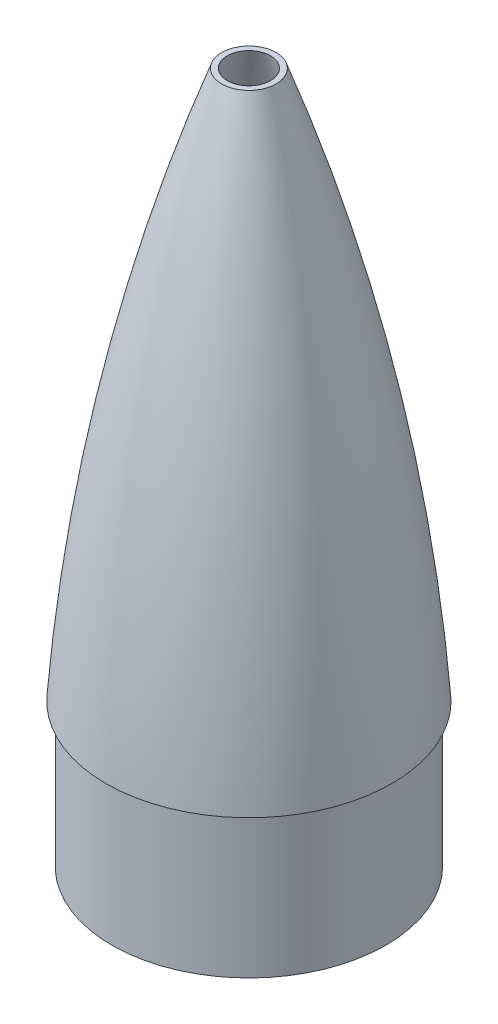
ISO-10303-21;
HEADER;
FILE_DESCRIPTION(('STEP AP214'),'2;1');
FILE_NAME('part.step','',(''),(''),'','','');
FILE_SCHEMA(('AUTOMOTIVE_DESIGN { 1 0 10303 214 1 1 1 1 }'));
ENDSEC;
DATA;
#1=APPLICATION_CONTEXT('core data for automotive mechanical design processes');
#2=APPLICATION_PROTOCOL_DEFINITION('international standard','automotive_design',2000,#1);
#3=PRODUCT_CONTEXT('',#1,'mechanical');
#4=PRODUCT('Part','Part','',(#3));
#5=PRODUCT_RELATED_PRODUCT_CATEGORY('part','',(#4));
#6=PRODUCT_DEFINITION_FORMATION('','',#4);
#7=PRODUCT_DEFINITION_CONTEXT('part definition',#1,'design');
#8=PRODUCT_DEFINITION('design','',#6,#7);
#9=PRODUCT_DEFINITION_SHAPE('','',#8);
#10=(LENGTH_UNIT() NAMED_UNIT(*) SI_UNIT(.MILLI.,.METRE.));
#11=(NAMED_UNIT(*) PLANE_ANGLE_UNIT() SI_UNIT($,.RADIAN.));
#12=(NAMED_UNIT(*) SI_UNIT($,.STERADIAN.) SOLID_ANGLE_UNIT());
#13=UNCERTAINTY_MEASURE_WITH_UNIT(LENGTH_MEASURE(1.E-05),#10,'distance_accuracy_value','');
#14=(GEOMETRIC_REPRESENTATION_CONTEXT(3) GLOBAL_UNCERTAINTY_ASSIGNED_CONTEXT((#13)) GLOBAL_UNIT_ASSIGNED_CONTEXT((#10,
#11,#12)) REPRESENTATION_CONTEXT('',''));
#15=CARTESIAN_POINT('',(0.,0.,0.));
#16=DIRECTION('',(0.,0.,1.));
#17=DIRECTION('',(1.,0.,0.));
#18=AXIS2_PLACEMENT_3D('',#15,#16,#17);
#19=CARTESIAN_POINT('',(2.22044604925031E-13,-77.7824394206784,0.));
#20=DIRECTION('',(0.,1.,0.));
#21=DIRECTION('',(-1.,0.,0.));
#22=AXIS2_PLACEMENT_3D('',#19,#20,#21);
#23=DEGENERATE_TOROIDAL_SURFACE('',#22,1014.39057082294,1093.36082838655,.F.);
#24=CARTESIAN_POINT('',(2.42627023847075E-13,0.,0.));
#25=DIRECTION('',(0.,1.,0.));
#26=DIRECTION('',(-1.,0.,0.));
#27=AXIS2_PLACEMENT_3D('',#24,#25,#26);
#28=CIRCLE('',#27,76.2000000000002);
#29=CARTESIAN_POINT('',(-76.2,0.,0.));
#30=VERTEX_POINT('',#29);
#31=EDGE_CURVE('E45',#30,#30,#28,.T.);
#32=ORIENTED_EDGE('',*,*,#31,.T.);
#33=EDGE_LOOP('',(#32));
#34=FACE_BOUND('',#33,.T.);
#35=CARTESIAN_POINT('',(2.22044604925031E-13,292.1,0.));
#36=DIRECTION('',(0.,1.,0.));
#37=DIRECTION('',(0.,0.,1.));
#38=AXIS2_PLACEMENT_3D('',#35,#36,#37);
#39=CIRCLE('',#38,14.5044102408933);
#40=CARTESIAN_POINT('',(2.22044604925031E-13,292.1,14.5044102408933));
#41=VERTEX_POINT('',#40);
#42=EDGE_CURVE('E55',#41,#41,#39,.F.);
#43=ORIENTED_EDGE('',*,*,#42,.T.);
#44=EDGE_LOOP('',(#43));
#45=FACE_BOUND('',#44,.T.);
#46=ADVANCED_FACE('F38',(#34,#45),#23,.F.);
#47=CARTESIAN_POINT('',(2.22044604925031E-13,-88.4854003678518,0.));
#48=DIRECTION('',(0.,1.,0.));
#49=DIRECTION('',(-1.,0.,0.));
#50=AXIS2_PLACEMENT_3D('',#47,#48,#49);
#51=DEGENERATE_TOROIDAL_SURFACE('',#50,1133.57722716672,1206.67591223346,.F.);
#52=CARTESIAN_POINT('',(2.42627023847075E-13,-1.11022302462516E-13,0.));
#53=DIRECTION('',(0.,1.,0.));
#54=DIRECTION('',(-1.,0.,0.));
#55=AXIS2_PLACEMENT_3D('',#52,#53,#54);
#56=CIRCLE('',#55,69.8500000000002);
#57=CARTESIAN_POINT('',(-69.85,-1.62347249814782E-13,0.));
#58=VERTEX_POINT('',#57);
#59=EDGE_CURVE('E50',#58,#58,#56,.T.);
#60=ORIENTED_EDGE('',*,*,#59,.F.);
#61=EDGE_LOOP('',(#60));
#62=FACE_BOUND('',#61,.T.);
#63=CARTESIAN_POINT('',(2.22044604925031E-13,292.1,0.));
#64=DIRECTION('',(0.,1.,0.));
#65=DIRECTION('',(0.,0.,1.));
#66=AXIS2_PLACEMENT_3D('',#63,#64,#65);
#67=CIRCLE('',#66,11.5085819285119);
#68=CARTESIAN_POINT('',(2.22044604925031E-13,292.1,11.5085819285119));
#69=VERTEX_POINT('',#68);
#70=EDGE_CURVE('E41',#69,#69,#67,.T.);
#71=ORIENTED_EDGE('',*,*,#70,.T.);
#72=EDGE_LOOP('',(#71));
#73=FACE_BOUND('',#72,.T.);
#74=ADVANCED_FACE('F63',(#62,#73),#51,.T.);
#75=CARTESIAN_POINT('',(-76.2,0.,0.));
#76=DIRECTION('',(0.,-1.,0.));
#77=DIRECTION('',(1.,0.,0.));
#78=AXIS2_PLACEMENT_3D('',#75,#76,#77);
#79=PLANE('',#78);
#80=CARTESIAN_POINT('',(0.,0.,0.));
#81=DIRECTION('',(0.,-1.,0.));
#82=DIRECTION('',(1.,0.,0.));
#83=AXIS2_PLACEMENT_3D('',#80,#81,#82);
#84=CIRCLE('',#83,73.025);
#85=CARTESIAN_POINT('',(73.025,-1.2520176551083E-13,0.));
#86=VERTEX_POINT('',#85);
#87=EDGE_CURVE('E10',#86,#86,#84,.T.);
#88=ORIENTED_EDGE('',*,*,#87,.F.);
#89=EDGE_LOOP('',(#88));
#90=FACE_BOUND('',#89,.T.);
#91=ORIENTED_EDGE('',*,*,#31,.F.);
#92=EDGE_LOOP('',(#91));
#93=FACE_BOUND('',#92,.T.);
#94=ADVANCED_FACE('F66',(#90,#93),#79,.T.);
#95=CARTESIAN_POINT('',(0.,292.1,0.));
#96=DIRECTION('',(0.,1.,0.));
#97=DIRECTION('',(0.,0.,1.));
#98=AXIS2_PLACEMENT_3D('',#95,#96,#97);
#99=PLANE('',#98);
#100=ORIENTED_EDGE('',*,*,#42,.F.);
#101=EDGE_LOOP('',(#100));
#102=FACE_BOUND('',#101,.T.);
#103=ORIENTED_EDGE('',*,*,#70,.F.);
#104=EDGE_LOOP('',(#103));
#105=FACE_BOUND('',#104,.T.);
#106=ADVANCED_FACE('F82',(#102,#105),#99,.T.);
#107=CARTESIAN_POINT('',(-1.3064532053304E-13,-76.2,0.));
#108=DIRECTION('',(0.,-1.,0.));
#109=DIRECTION('',(1.,0.,0.));
#110=AXIS2_PLACEMENT_3D('',#107,#108,#109);
#111=PLANE('',#110);
#112=CARTESIAN_POINT('',(-1.3064532053304E-13,-76.2,0.));
#113=DIRECTION('',(0.,-1.,0.));
#114=DIRECTION('',(1.,0.,0.));
#115=AXIS2_PLACEMENT_3D('',#112,#113,#114);
#116=CIRCLE('',#115,73.025);
#117=CARTESIAN_POINT('',(73.0249999999999,-76.2000000000001,0.));
#118=VERTEX_POINT('',#117);
#119=EDGE_CURVE('E53',#118,#118,#116,.T.);
#120=ORIENTED_EDGE('',*,*,#119,.T.);
#121=EDGE_LOOP('',(#120));
#122=FACE_BOUND('',#121,.T.);
#123=CARTESIAN_POINT('',(-1.3064532053304E-13,-76.2,0.));
#124=DIRECTION('',(0.,-1.,0.));
#125=DIRECTION('',(1.,0.,0.));
#126=AXIS2_PLACEMENT_3D('',#123,#124,#125);
#127=CIRCLE('',#126,69.85);
#128=CARTESIAN_POINT('',(69.8499999999999,-76.2000000000001,0.));
#129=VERTEX_POINT('',#128);
#130=EDGE_CURVE('E72',#129,#129,#127,.T.);
#131=ORIENTED_EDGE('',*,*,#130,.F.);
#132=EDGE_LOOP('',(#131));
#133=FACE_BOUND('',#132,.T.);
#134=ADVANCED_FACE('F79',(#122,#133),#111,.T.);
#135=CARTESIAN_POINT('',(-1.3064532053304E-13,-76.2,0.));
#136=DIRECTION('',(0.,1.,0.));
#137=DIRECTION('',(-1.,0.,0.));
#138=AXIS2_PLACEMENT_3D('',#135,#136,#137);
#139=CYLINDRICAL_SURFACE('',#138,73.025);
#140=ORIENTED_EDGE('',*,*,#119,.F.);
#141=EDGE_LOOP('',(#140));
#142=FACE_BOUND('',#141,.T.);
#143=ORIENTED_EDGE('',*,*,#87,.T.);
#144=EDGE_LOOP('',(#143));
#145=FACE_BOUND('',#144,.T.);
#146=ADVANCED_FACE('F81',(#142,#145),#139,.T.);
#147=CARTESIAN_POINT('',(-1.3064532053304E-13,-76.2,0.));
#148=DIRECTION('',(0.,1.,0.));
#149=DIRECTION('',(-1.,0.,0.));
#150=AXIS2_PLACEMENT_3D('',#147,#148,#149);
#151=CYLINDRICAL_SURFACE('',#150,69.85);
#152=ORIENTED_EDGE('',*,*,#130,.T.);
#153=EDGE_LOOP('',(#152));
#154=FACE_BOUND('',#153,.T.);
#155=ORIENTED_EDGE('',*,*,#59,.T.);
#156=EDGE_LOOP('',(#155));
#157=FACE_BOUND('',#156,.T.);
#158=ADVANCED_FACE('F61',(#154,#157),#151,.F.);
#159=CLOSED_SHELL('',(#46,#74,#94,#106,#134,#146,#158));
#160=MANIFOLD_SOLID_BREP('B2',#159);
#161=ADVANCED_BREP_SHAPE_REPRESENTATION('',(#18,#160),#14);
#162=SHAPE_DEFINITION_REPRESENTATION(#9,#161);
ENDSEC;
END-ISO-10303-21;
